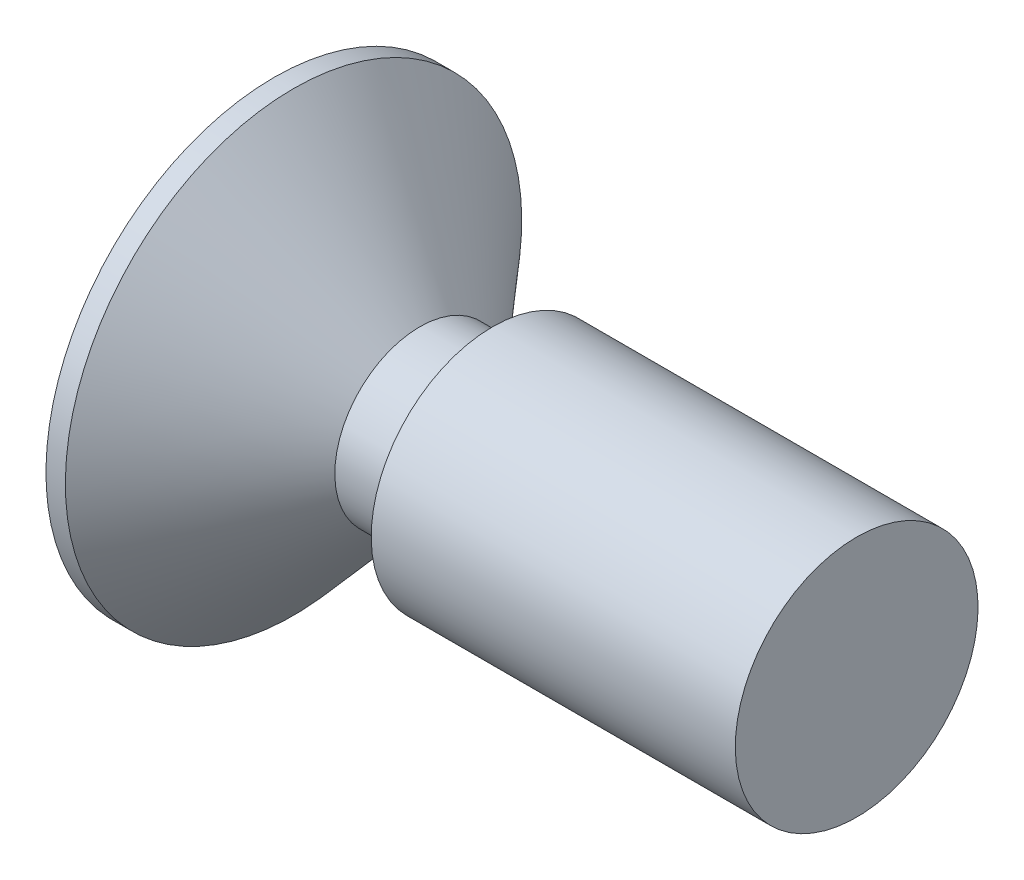
ISO-10303-21;
HEADER;
FILE_DESCRIPTION(('STEP AP214'),'2;1');
FILE_NAME('part.step','',(''),(''),'','','');
FILE_SCHEMA(('AUTOMOTIVE_DESIGN { 1 0 10303 214 1 1 1 1 }'));
ENDSEC;
DATA;
#1=APPLICATION_CONTEXT('core data for automotive mechanical design processes');
#2=APPLICATION_PROTOCOL_DEFINITION('international standard','automotive_design',2000,#1);
#3=PRODUCT_CONTEXT('',#1,'mechanical');
#4=PRODUCT('Part','Part','',(#3));
#5=PRODUCT_RELATED_PRODUCT_CATEGORY('part','',(#4));
#6=PRODUCT_DEFINITION_FORMATION('','',#4);
#7=PRODUCT_DEFINITION_CONTEXT('part definition',#1,'design');
#8=PRODUCT_DEFINITION('design','',#6,#7);
#9=PRODUCT_DEFINITION_SHAPE('','',#8);
#10=(LENGTH_UNIT() NAMED_UNIT(*) SI_UNIT(.MILLI.,.METRE.));
#11=(NAMED_UNIT(*) PLANE_ANGLE_UNIT() SI_UNIT($,.RADIAN.));
#12=(NAMED_UNIT(*) SI_UNIT($,.STERADIAN.) SOLID_ANGLE_UNIT());
#13=UNCERTAINTY_MEASURE_WITH_UNIT(LENGTH_MEASURE(1.E-05),#10,'distance_accuracy_value','');
#14=(GEOMETRIC_REPRESENTATION_CONTEXT(3) GLOBAL_UNCERTAINTY_ASSIGNED_CONTEXT((#13)) GLOBAL_UNIT_ASSIGNED_CONTEXT((#10,
#11,#12)) REPRESENTATION_CONTEXT('',''));
#15=CARTESIAN_POINT('',(0.,0.,0.));
#16=DIRECTION('',(0.,0.,1.));
#17=DIRECTION('',(1.,0.,0.));
#18=AXIS2_PLACEMENT_3D('',#15,#16,#17);
#19=CARTESIAN_POINT('',(0.,0.,0.));
#20=DIRECTION('',(1.,0.,0.));
#21=DIRECTION('',(0.,1.,0.));
#22=AXIS2_PLACEMENT_3D('',#19,#20,#21);
#23=PLANE('',#22);
#24=CARTESIAN_POINT('',(0.,0.,0.));
#25=DIRECTION('',(1.,0.,0.));
#26=DIRECTION('',(0.,1.,0.));
#27=AXIS2_PLACEMENT_3D('',#24,#25,#26);
#28=CIRCLE('',#27,1.25);
#29=CARTESIAN_POINT('',(0.,1.25,0.));
#30=VERTEX_POINT('',#29);
#31=EDGE_CURVE('E11',#30,#30,#28,.T.);
#32=ORIENTED_EDGE('',*,*,#31,.T.);
#33=EDGE_LOOP('',(#32));
#34=FACE_BOUND('',#33,.T.);
#35=ADVANCED_FACE('F42',(#34),#23,.T.);
#36=CARTESIAN_POINT('',(0.,0.,0.));
#37=DIRECTION('',(1.,0.,0.));
#38=DIRECTION('',(0.,1.,0.));
#39=AXIS2_PLACEMENT_3D('',#36,#37,#38);
#40=CYLINDRICAL_SURFACE('',#39,1.25);
#41=CARTESIAN_POINT('',(-3.75,0.,0.));
#42=DIRECTION('',(1.,0.,0.));
#43=DIRECTION('',(0.,1.,0.));
#44=AXIS2_PLACEMENT_3D('',#41,#42,#43);
#45=CIRCLE('',#44,1.25000000000001);
#46=CARTESIAN_POINT('',(-3.75,1.25000000000001,0.));
#47=VERTEX_POINT('',#46);
#48=EDGE_CURVE('E50',#47,#47,#45,.T.);
#49=ORIENTED_EDGE('',*,*,#48,.T.);
#50=EDGE_LOOP('',(#49));
#51=FACE_BOUND('',#50,.T.);
#52=ORIENTED_EDGE('',*,*,#31,.F.);
#53=EDGE_LOOP('',(#52));
#54=FACE_BOUND('',#53,.T.);
#55=ADVANCED_FACE('F316',(#51,#54),#40,.T.);
#56=CARTESIAN_POINT('',(-3.75,1.25000000000001,0.));
#57=DIRECTION('',(-1.,0.,0.));
#58=DIRECTION('',(0.,-1.,0.));
#59=AXIS2_PLACEMENT_3D('',#56,#57,#58);
#60=PLANE('',#59);
#61=CARTESIAN_POINT('',(-3.75,0.,0.));
#62=DIRECTION('',(1.,0.,0.));
#63=DIRECTION('',(0.,1.,0.));
#64=AXIS2_PLACEMENT_3D('',#61,#62,#63);
#65=CIRCLE('',#64,0.875000000000007);
#66=CARTESIAN_POINT('',(-3.75,0.875000000000006,0.));
#67=VERTEX_POINT('',#66);
#68=EDGE_CURVE('E308',#67,#67,#65,.T.);
#69=ORIENTED_EDGE('',*,*,#68,.T.);
#70=EDGE_LOOP('',(#69));
#71=FACE_BOUND('',#70,.T.);
#72=ORIENTED_EDGE('',*,*,#48,.F.);
#73=EDGE_LOOP('',(#72));
#74=FACE_BOUND('',#73,.T.);
#75=ADVANCED_FACE('F319',(#71,#74),#60,.T.);
#76=CARTESIAN_POINT('',(0.,0.,0.));
#77=DIRECTION('',(1.,0.,0.));
#78=DIRECTION('',(0.,1.,0.));
#79=AXIS2_PLACEMENT_3D('',#76,#77,#78);
#80=CYLINDRICAL_SURFACE('',#79,0.875000000000007);
#81=CARTESIAN_POINT('',(-4.5,0.,0.));
#82=DIRECTION('',(1.,0.,0.));
#83=DIRECTION('',(0.,1.,0.));
#84=AXIS2_PLACEMENT_3D('',#81,#82,#83);
#85=CIRCLE('',#84,0.875000000000007);
#86=CARTESIAN_POINT('',(-4.5,0.875000000000006,0.));
#87=VERTEX_POINT('',#86);
#88=EDGE_CURVE('E304',#87,#87,#85,.T.);
#89=ORIENTED_EDGE('',*,*,#88,.T.);
#90=EDGE_LOOP('',(#89));
#91=FACE_BOUND('',#90,.T.);
#92=ORIENTED_EDGE('',*,*,#68,.F.);
#93=EDGE_LOOP('',(#92));
#94=FACE_BOUND('',#93,.T.);
#95=ADVANCED_FACE('F321',(#91,#94),#80,.T.);
#96=CARTESIAN_POINT('',(-4.5,0.,0.));
#97=DIRECTION('',(-1.,0.,0.));
#98=DIRECTION('',(0.,-1.,0.));
#99=AXIS2_PLACEMENT_3D('',#96,#97,#98);
#100=CONICAL_SURFACE('',#99,0.875000000000007,0.84837782583039);
#101=CARTESIAN_POINT('',(-5.8,0.,0.));
#102=DIRECTION('',(1.,0.,0.));
#103=DIRECTION('',(0.,1.,0.));
#104=AXIS2_PLACEMENT_3D('',#101,#102,#103);
#105=CIRCLE('',#104,2.35);
#106=CARTESIAN_POINT('',(-5.8,2.35,0.));
#107=VERTEX_POINT('',#106);
#108=EDGE_CURVE('E300',#107,#107,#105,.T.);
#109=ORIENTED_EDGE('',*,*,#108,.T.);
#110=EDGE_LOOP('',(#109));
#111=FACE_BOUND('',#110,.T.);
#112=ORIENTED_EDGE('',*,*,#88,.F.);
#113=EDGE_LOOP('',(#112));
#114=FACE_BOUND('',#113,.T.);
#115=ADVANCED_FACE('F328',(#111,#114),#100,.T.);
#116=CARTESIAN_POINT('',(0.,0.,0.));
#117=DIRECTION('',(1.,0.,0.));
#118=DIRECTION('',(0.,1.,0.));
#119=AXIS2_PLACEMENT_3D('',#116,#117,#118);
#120=CYLINDRICAL_SURFACE('',#119,2.35);
#121=CARTESIAN_POINT('',(-6.,0.,0.));
#122=DIRECTION('',(1.,0.,0.));
#123=DIRECTION('',(0.,1.,0.));
#124=AXIS2_PLACEMENT_3D('',#121,#122,#123);
#125=CIRCLE('',#124,2.35);
#126=CARTESIAN_POINT('',(-6.,2.35,0.));
#127=VERTEX_POINT('',#126);
#128=EDGE_CURVE('E257',#127,#127,#125,.T.);
#129=ORIENTED_EDGE('',*,*,#128,.T.);
#130=EDGE_LOOP('',(#129));
#131=FACE_BOUND('',#130,.T.);
#132=ORIENTED_EDGE('',*,*,#108,.F.);
#133=EDGE_LOOP('',(#132));
#134=FACE_BOUND('',#133,.T.);
#135=ADVANCED_FACE('F354',(#131,#134),#120,.T.);
#136=CARTESIAN_POINT('',(-6.,2.35,0.));
#137=DIRECTION('',(-1.,0.,0.));
#138=DIRECTION('',(0.,-1.,0.));
#139=AXIS2_PLACEMENT_3D('',#136,#137,#138);
#140=PLANE('',#139);
#141=DIRECTION('',(0.,-1.,0.));
#142=VECTOR('',#141,1.);
#143=CARTESIAN_POINT('',(-6.,1.5,-0.3125));
#144=LINE('',#143,#142);
#145=CARTESIAN_POINT('',(-6.,1.5,-0.3125));
#146=VERTEX_POINT('',#145);
#147=CARTESIAN_POINT('',(-6.,0.5625,-0.3125));
#148=VERTEX_POINT('',#147);
#149=EDGE_CURVE('E57',#146,#148,#144,.T.);
#150=ORIENTED_EDGE('',*,*,#149,.F.);
#151=DIRECTION('',(0.,0.,-1.));
#152=VECTOR('',#151,1.);
#153=CARTESIAN_POINT('',(-6.,1.5,-0.3125));
#154=LINE('',#153,#152);
#155=CARTESIAN_POINT('',(-6.,1.5,0.3125));
#156=VERTEX_POINT('',#155);
#157=EDGE_CURVE('E251',#156,#146,#154,.T.);
#158=ORIENTED_EDGE('',*,*,#157,.F.);
#159=DIRECTION('',(0.,1.,0.));
#160=VECTOR('',#159,1.);
#161=CARTESIAN_POINT('',(-6.,1.5,0.3125));
#162=LINE('',#161,#160);
#163=CARTESIAN_POINT('',(-6.,0.5625,0.3125));
#164=VERTEX_POINT('',#163);
#165=EDGE_CURVE('E248',#164,#156,#162,.T.);
#166=ORIENTED_EDGE('',*,*,#165,.F.);
#167=CARTESIAN_POINT('',(-6.,0.562499999999999,0.5625));
#168=DIRECTION('',(1.,0.,0.));
#169=DIRECTION('',(0.,1.,0.));
#170=AXIS2_PLACEMENT_3D('',#167,#168,#169);
#171=CIRCLE('',#170,0.25);
#172=CARTESIAN_POINT('',(-6.,0.312499999999999,0.5625));
#173=VERTEX_POINT('',#172);
#174=EDGE_CURVE('E165',#173,#164,#171,.T.);
#175=ORIENTED_EDGE('',*,*,#174,.F.);
#176=DIRECTION('',(0.,0.,-1.));
#177=VECTOR('',#176,1.);
#178=CARTESIAN_POINT('',(-6.,0.312499999999999,0.5625));
#179=LINE('',#178,#177);
#180=CARTESIAN_POINT('',(-6.,0.312499999999999,1.5));
#181=VERTEX_POINT('',#180);
#182=EDGE_CURVE('E242',#181,#173,#179,.T.);
#183=ORIENTED_EDGE('',*,*,#182,.F.);
#184=DIRECTION('',(0.,1.,0.));
#185=VECTOR('',#184,1.);
#186=CARTESIAN_POINT('',(-6.,0.312499999999999,1.5));
#187=LINE('',#186,#185);
#188=CARTESIAN_POINT('',(-6.,-0.312500000000001,1.5));
#189=VERTEX_POINT('',#188);
#190=EDGE_CURVE('E239',#189,#181,#187,.T.);
#191=ORIENTED_EDGE('',*,*,#190,.F.);
#192=DIRECTION('',(0.,0.,1.));
#193=VECTOR('',#192,1.);
#194=CARTESIAN_POINT('',(-6.,-0.312500000000001,0.562500000000001));
#195=LINE('',#194,#193);
#196=CARTESIAN_POINT('',(-6.,-0.312500000000001,0.562500000000001));
#197=VERTEX_POINT('',#196);
#198=EDGE_CURVE('E235',#197,#189,#195,.T.);
#199=ORIENTED_EDGE('',*,*,#198,.F.);
#200=CARTESIAN_POINT('',(-6.,-0.562500000000001,0.5625));
#201=DIRECTION('',(1.,0.,0.));
#202=DIRECTION('',(0.,1.,0.));
#203=AXIS2_PLACEMENT_3D('',#200,#201,#202);
#204=CIRCLE('',#203,0.25);
#205=CARTESIAN_POINT('',(-6.,-0.562500000000001,0.3125));
#206=VERTEX_POINT('',#205);
#207=EDGE_CURVE('E231',#206,#197,#204,.T.);
#208=ORIENTED_EDGE('',*,*,#207,.F.);
#209=DIRECTION('',(0.,1.,0.));
#210=VECTOR('',#209,1.);
#211=CARTESIAN_POINT('',(-6.,-0.562500000000001,0.312500000000001));
#212=LINE('',#211,#210);
#213=CARTESIAN_POINT('',(-6.,-1.5,0.3125));
#214=VERTEX_POINT('',#213);
#215=EDGE_CURVE('E227',#214,#206,#212,.T.);
#216=ORIENTED_EDGE('',*,*,#215,.F.);
#217=DIRECTION('',(0.,0.,1.));
#218=VECTOR('',#217,1.);
#219=CARTESIAN_POINT('',(-6.,-1.5,-0.3125));
#220=LINE('',#219,#218);
#221=CARTESIAN_POINT('',(-6.,-1.5,-0.3125));
#222=VERTEX_POINT('',#221);
#223=EDGE_CURVE('E223',#222,#214,#220,.T.);
#224=ORIENTED_EDGE('',*,*,#223,.F.);
#225=DIRECTION('',(0.,-1.,0.));
#226=VECTOR('',#225,1.);
#227=CARTESIAN_POINT('',(-6.,-0.562500000000001,-0.3125));
#228=LINE('',#227,#226);
#229=CARTESIAN_POINT('',(-6.,-0.562500000000001,-0.3125));
#230=VERTEX_POINT('',#229);
#231=EDGE_CURVE('E219',#230,#222,#228,.T.);
#232=ORIENTED_EDGE('',*,*,#231,.F.);
#233=CARTESIAN_POINT('',(-6.,-0.562500000000001,-0.5625));
#234=DIRECTION('',(1.,0.,0.));
#235=DIRECTION('',(0.,-1.,0.));
#236=AXIS2_PLACEMENT_3D('',#233,#234,#235);
#237=CIRCLE('',#236,0.25);
#238=CARTESIAN_POINT('',(-6.,-0.312500000000001,-0.5625));
#239=VERTEX_POINT('',#238);
#240=EDGE_CURVE('E215',#239,#230,#237,.T.);
#241=ORIENTED_EDGE('',*,*,#240,.F.);
#242=DIRECTION('',(0.,0.,1.));
#243=VECTOR('',#242,1.);
#244=CARTESIAN_POINT('',(-6.,-0.312500000000001,-1.5));
#245=LINE('',#244,#243);
#246=CARTESIAN_POINT('',(-6.,-0.312500000000001,-1.5));
#247=VERTEX_POINT('',#246);
#248=EDGE_CURVE('E211',#247,#239,#245,.T.);
#249=ORIENTED_EDGE('',*,*,#248,.F.);
#250=DIRECTION('',(0.,-1.,0.));
#251=VECTOR('',#250,1.);
#252=CARTESIAN_POINT('',(-6.,0.3125,-1.5));
#253=LINE('',#252,#251);
#254=CARTESIAN_POINT('',(-6.,0.3125,-1.5));
#255=VERTEX_POINT('',#254);
#256=EDGE_CURVE('E207',#255,#247,#253,.T.);
#257=ORIENTED_EDGE('',*,*,#256,.F.);
#258=DIRECTION('',(0.,0.,-1.));
#259=VECTOR('',#258,1.);
#260=CARTESIAN_POINT('',(-6.,0.3125,-1.5));
#261=LINE('',#260,#259);
#262=CARTESIAN_POINT('',(-6.,0.312499999999999,-0.5625));
#263=VERTEX_POINT('',#262);
#264=EDGE_CURVE('E203',#263,#255,#261,.T.);
#265=ORIENTED_EDGE('',*,*,#264,.F.);
#266=CARTESIAN_POINT('',(-6.,0.562499999999999,-0.5625));
#267=DIRECTION('',(1.,0.,0.));
#268=DIRECTION('',(0.,1.,0.));
#269=AXIS2_PLACEMENT_3D('',#266,#267,#268);
#270=CIRCLE('',#269,0.25);
#271=EDGE_CURVE('E199',#148,#263,#270,.T.);
#272=ORIENTED_EDGE('',*,*,#271,.F.);
#273=EDGE_LOOP('',(#150,#158,#166,#175,#183,#191,#199,#208,#216,#224,#232,#241,#249,#257,#265,#272));
#274=FACE_BOUND('',#273,.T.);
#275=ORIENTED_EDGE('',*,*,#128,.F.);
#276=EDGE_LOOP('',(#275));
#277=FACE_BOUND('',#276,.T.);
#278=ADVANCED_FACE('F363',(#274,#277),#140,.T.);
#279=CARTESIAN_POINT('',(-5.25,1.5,-0.3125));
#280=DIRECTION('',(0.,0.,-1.));
#281=DIRECTION('',(-1.,0.,0.));
#282=AXIS2_PLACEMENT_3D('',#279,#280,#281);
#283=PLANE('',#282);
#284=ORIENTED_EDGE('',*,*,#149,.T.);
#285=DIRECTION('',(-1.,0.,0.));
#286=VECTOR('',#285,1.);
#287=CARTESIAN_POINT('',(-5.25,0.5625,-0.3125));
#288=LINE('',#287,#286);
#289=CARTESIAN_POINT('',(-5.25,0.5625,-0.3125));
#290=VERTEX_POINT('',#289);
#291=EDGE_CURVE('E117',#290,#148,#288,.T.);
#292=ORIENTED_EDGE('',*,*,#291,.F.);
#293=DIRECTION('',(0.,-1.,0.));
#294=VECTOR('',#293,1.);
#295=CARTESIAN_POINT('',(-5.25,1.5,-0.3125));
#296=LINE('',#295,#294);
#297=CARTESIAN_POINT('',(-5.25,1.5,-0.3125));
#298=VERTEX_POINT('',#297);
#299=EDGE_CURVE('E254',#298,#290,#296,.T.);
#300=ORIENTED_EDGE('',*,*,#299,.F.);
#301=DIRECTION('',(-1.,0.,0.));
#302=VECTOR('',#301,1.);
#303=CARTESIAN_POINT('',(-5.25,1.5,-0.3125));
#304=LINE('',#303,#302);
#305=EDGE_CURVE('E65',#298,#146,#304,.T.);
#306=ORIENTED_EDGE('',*,*,#305,.T.);
#307=EDGE_LOOP('',(#284,#292,#300,#306));
#308=FACE_BOUND('',#307,.T.);
#309=ADVANCED_FACE('F372',(#308),#283,.F.);
#310=CARTESIAN_POINT('',(-5.25,1.5,-0.3125));
#311=DIRECTION('',(0.,1.,0.));
#312=DIRECTION('',(-1.,0.,0.));
#313=AXIS2_PLACEMENT_3D('',#310,#311,#312);
#314=PLANE('',#313);
#315=ORIENTED_EDGE('',*,*,#157,.T.);
#316=ORIENTED_EDGE('',*,*,#305,.F.);
#317=DIRECTION('',(0.,0.,-1.));
#318=VECTOR('',#317,1.);
#319=CARTESIAN_POINT('',(-5.25,1.5,-0.3125));
#320=LINE('',#319,#318);
#321=CARTESIAN_POINT('',(-5.25,1.5,0.3125));
#322=VERTEX_POINT('',#321);
#323=EDGE_CURVE('E179',#322,#298,#320,.T.);
#324=ORIENTED_EDGE('',*,*,#323,.F.);
#325=DIRECTION('',(-1.,0.,0.));
#326=VECTOR('',#325,1.);
#327=CARTESIAN_POINT('',(-5.25,1.5,0.3125));
#328=LINE('',#327,#326);
#329=EDGE_CURVE('E170',#322,#156,#328,.T.);
#330=ORIENTED_EDGE('',*,*,#329,.T.);
#331=EDGE_LOOP('',(#315,#316,#324,#330));
#332=FACE_BOUND('',#331,.T.);
#333=ADVANCED_FACE('F381',(#332),#314,.F.);
#334=CARTESIAN_POINT('',(-5.25,1.5,0.3125));
#335=DIRECTION('',(0.,0.,1.));
#336=DIRECTION('',(0.,-1.,0.));
#337=AXIS2_PLACEMENT_3D('',#334,#335,#336);
#338=PLANE('',#337);
#339=ORIENTED_EDGE('',*,*,#165,.T.);
#340=ORIENTED_EDGE('',*,*,#329,.F.);
#341=DIRECTION('',(0.,1.,0.));
#342=VECTOR('',#341,1.);
#343=CARTESIAN_POINT('',(-5.25,1.5,0.3125));
#344=LINE('',#343,#342);
#345=CARTESIAN_POINT('',(-5.25,0.5625,0.3125));
#346=VERTEX_POINT('',#345);
#347=EDGE_CURVE('E174',#346,#322,#344,.T.);
#348=ORIENTED_EDGE('',*,*,#347,.F.);
#349=DIRECTION('',(-1.,0.,0.));
#350=VECTOR('',#349,1.);
#351=CARTESIAN_POINT('',(-5.25,0.5625,0.3125));
#352=LINE('',#351,#350);
#353=EDGE_CURVE('E158',#346,#164,#352,.T.);
#354=ORIENTED_EDGE('',*,*,#353,.T.);
#355=EDGE_LOOP('',(#339,#340,#348,#354));
#356=FACE_BOUND('',#355,.T.);
#357=ADVANCED_FACE('F175',(#356),#338,.F.);
#358=CARTESIAN_POINT('',(-5.25,0.562499999999999,0.5625));
#359=DIRECTION('',(-1.,0.,0.));
#360=DIRECTION('',(0.,-1.,0.));
#361=AXIS2_PLACEMENT_3D('',#358,#359,#360);
#362=CYLINDRICAL_SURFACE('',#361,0.25);
#363=ORIENTED_EDGE('',*,*,#174,.T.);
#364=ORIENTED_EDGE('',*,*,#353,.F.);
#365=CARTESIAN_POINT('',(-5.25,0.562499999999999,0.5625));
#366=DIRECTION('',(1.,0.,0.));
#367=DIRECTION('',(0.,1.,0.));
#368=AXIS2_PLACEMENT_3D('',#365,#366,#367);
#369=CIRCLE('',#368,0.25);
#370=CARTESIAN_POINT('',(-5.25,0.312499999999999,0.5625));
#371=VERTEX_POINT('',#370);
#372=EDGE_CURVE('E162',#371,#346,#369,.T.);
#373=ORIENTED_EDGE('',*,*,#372,.F.);
#374=DIRECTION('',(-1.,0.,0.));
#375=VECTOR('',#374,1.);
#376=CARTESIAN_POINT('',(-5.25,0.312499999999999,0.5625));
#377=LINE('',#376,#375);
#378=EDGE_CURVE('E171',#371,#173,#377,.T.);
#379=ORIENTED_EDGE('',*,*,#378,.T.);
#380=EDGE_LOOP('',(#363,#364,#373,#379));
#381=FACE_BOUND('',#380,.T.);
#382=ADVANCED_FACE('F160',(#381),#362,.T.);
#383=CARTESIAN_POINT('',(-5.25,0.3125,0.5625));
#384=DIRECTION('',(0.,1.,0.));
#385=DIRECTION('',(-1.,0.,0.));
#386=AXIS2_PLACEMENT_3D('',#383,#384,#385);
#387=PLANE('',#386);
#388=ORIENTED_EDGE('',*,*,#182,.T.);
#389=ORIENTED_EDGE('',*,*,#378,.F.);
#390=DIRECTION('',(0.,0.,-1.));
#391=VECTOR('',#390,1.);
#392=CARTESIAN_POINT('',(-5.25,0.3125,0.5625));
#393=LINE('',#392,#391);
#394=CARTESIAN_POINT('',(-5.25,0.3125,1.5));
#395=VERTEX_POINT('',#394);
#396=EDGE_CURVE('E185',#395,#371,#393,.T.);
#397=ORIENTED_EDGE('',*,*,#396,.F.);
#398=DIRECTION('',(-1.,0.,0.));
#399=VECTOR('',#398,1.);
#400=CARTESIAN_POINT('',(-5.25,0.3125,1.5));
#401=LINE('',#400,#399);
#402=EDGE_CURVE('E262',#395,#181,#401,.T.);
#403=ORIENTED_EDGE('',*,*,#402,.T.);
#404=EDGE_LOOP('',(#388,#389,#397,#403));
#405=FACE_BOUND('',#404,.T.);
#406=ADVANCED_FACE('F403',(#405),#387,.F.);
#407=CARTESIAN_POINT('',(-5.25,0.3125,1.5));
#408=DIRECTION('',(0.,0.,1.));
#409=DIRECTION('',(0.,-1.,0.));
#410=AXIS2_PLACEMENT_3D('',#407,#408,#409);
#411=PLANE('',#410);
#412=ORIENTED_EDGE('',*,*,#190,.T.);
#413=ORIENTED_EDGE('',*,*,#402,.F.);
#414=DIRECTION('',(0.,1.,0.));
#415=VECTOR('',#414,1.);
#416=CARTESIAN_POINT('',(-5.25,0.3125,1.5));
#417=LINE('',#416,#415);
#418=CARTESIAN_POINT('',(-5.25,-0.3125,1.5));
#419=VERTEX_POINT('',#418);
#420=EDGE_CURVE('E191',#419,#395,#417,.T.);
#421=ORIENTED_EDGE('',*,*,#420,.F.);
#422=DIRECTION('',(-1.,0.,0.));
#423=VECTOR('',#422,1.);
#424=CARTESIAN_POINT('',(-5.25,-0.3125,1.5));
#425=LINE('',#424,#423);
#426=EDGE_CURVE('E265',#419,#189,#425,.T.);
#427=ORIENTED_EDGE('',*,*,#426,.T.);
#428=EDGE_LOOP('',(#412,#413,#421,#427));
#429=FACE_BOUND('',#428,.T.);
#430=ADVANCED_FACE('F411',(#429),#411,.F.);
#431=CARTESIAN_POINT('',(-5.25,-0.3125,0.562500000000001));
#432=DIRECTION('',(0.,-1.,0.));
#433=DIRECTION('',(1.,0.,0.));
#434=AXIS2_PLACEMENT_3D('',#431,#432,#433);
#435=PLANE('',#434);
#436=ORIENTED_EDGE('',*,*,#198,.T.);
#437=ORIENTED_EDGE('',*,*,#426,.F.);
#438=DIRECTION('',(0.,0.,1.));
#439=VECTOR('',#438,1.);
#440=CARTESIAN_POINT('',(-5.25,-0.3125,0.562500000000001));
#441=LINE('',#440,#439);
#442=CARTESIAN_POINT('',(-5.25,-0.3125,0.562500000000001));
#443=VERTEX_POINT('',#442);
#444=EDGE_CURVE('E617',#443,#419,#441,.T.);
#445=ORIENTED_EDGE('',*,*,#444,.F.);
#446=DIRECTION('',(-1.,0.,0.));
#447=VECTOR('',#446,1.);
#448=CARTESIAN_POINT('',(-5.25,-0.3125,0.562500000000001));
#449=LINE('',#448,#447);
#450=EDGE_CURVE('E268',#443,#197,#449,.T.);
#451=ORIENTED_EDGE('',*,*,#450,.T.);
#452=EDGE_LOOP('',(#436,#437,#445,#451));
#453=FACE_BOUND('',#452,.T.);
#454=ADVANCED_FACE('F420',(#453),#435,.F.);
#455=CARTESIAN_POINT('',(-5.25,-0.5625,0.5625));
#456=DIRECTION('',(-1.,0.,0.));
#457=DIRECTION('',(0.,-1.,0.));
#458=AXIS2_PLACEMENT_3D('',#455,#456,#457);
#459=CYLINDRICAL_SURFACE('',#458,0.25);
#460=ORIENTED_EDGE('',*,*,#207,.T.);
#461=ORIENTED_EDGE('',*,*,#450,.F.);
#462=CARTESIAN_POINT('',(-5.25,-0.5625,0.5625));
#463=DIRECTION('',(1.,0.,0.));
#464=DIRECTION('',(0.,1.,0.));
#465=AXIS2_PLACEMENT_3D('',#462,#463,#464);
#466=CIRCLE('',#465,0.25);
#467=CARTESIAN_POINT('',(-5.25,-0.562500000000001,0.3125));
#468=VERTEX_POINT('',#467);
#469=EDGE_CURVE('E613',#468,#443,#466,.T.);
#470=ORIENTED_EDGE('',*,*,#469,.F.);
#471=DIRECTION('',(-1.,0.,0.));
#472=VECTOR('',#471,1.);
#473=CARTESIAN_POINT('',(-5.25,-0.562500000000001,0.3125));
#474=LINE('',#473,#472);
#475=EDGE_CURVE('E271',#468,#206,#474,.T.);
#476=ORIENTED_EDGE('',*,*,#475,.T.);
#477=EDGE_LOOP('',(#460,#461,#470,#476));
#478=FACE_BOUND('',#477,.T.);
#479=ADVANCED_FACE('F429',(#478),#459,.T.);
#480=CARTESIAN_POINT('',(-5.25,-0.562500000000001,0.312500000000001));
#481=DIRECTION('',(0.,0.,1.));
#482=DIRECTION('',(0.,-1.,0.));
#483=AXIS2_PLACEMENT_3D('',#480,#481,#482);
#484=PLANE('',#483);
#485=ORIENTED_EDGE('',*,*,#215,.T.);
#486=ORIENTED_EDGE('',*,*,#475,.F.);
#487=DIRECTION('',(0.,1.,0.));
#488=VECTOR('',#487,1.);
#489=CARTESIAN_POINT('',(-5.25,-0.562500000000001,0.312500000000001));
#490=LINE('',#489,#488);
#491=CARTESIAN_POINT('',(-5.25,-1.5,0.3125));
#492=VERTEX_POINT('',#491);
#493=EDGE_CURVE('E609',#492,#468,#490,.T.);
#494=ORIENTED_EDGE('',*,*,#493,.F.);
#495=DIRECTION('',(-1.,0.,0.));
#496=VECTOR('',#495,1.);
#497=CARTESIAN_POINT('',(-5.25,-1.5,0.3125));
#498=LINE('',#497,#496);
#499=EDGE_CURVE('E274',#492,#214,#498,.T.);
#500=ORIENTED_EDGE('',*,*,#499,.T.);
#501=EDGE_LOOP('',(#485,#486,#494,#500));
#502=FACE_BOUND('',#501,.T.);
#503=ADVANCED_FACE('F438',(#502),#484,.F.);
#504=CARTESIAN_POINT('',(-5.25,-1.5,-0.3125));
#505=DIRECTION('',(0.,-1.,0.));
#506=DIRECTION('',(1.,0.,0.));
#507=AXIS2_PLACEMENT_3D('',#504,#505,#506);
#508=PLANE('',#507);
#509=ORIENTED_EDGE('',*,*,#223,.T.);
#510=ORIENTED_EDGE('',*,*,#499,.F.);
#511=DIRECTION('',(0.,0.,1.));
#512=VECTOR('',#511,1.);
#513=CARTESIAN_POINT('',(-5.25,-1.5,-0.3125));
#514=LINE('',#513,#512);
#515=CARTESIAN_POINT('',(-5.25,-1.5,-0.3125));
#516=VERTEX_POINT('',#515);
#517=EDGE_CURVE('E605',#516,#492,#514,.T.);
#518=ORIENTED_EDGE('',*,*,#517,.F.);
#519=DIRECTION('',(-1.,0.,0.));
#520=VECTOR('',#519,1.);
#521=CARTESIAN_POINT('',(-5.25,-1.5,-0.3125));
#522=LINE('',#521,#520);
#523=EDGE_CURVE('E277',#516,#222,#522,.T.);
#524=ORIENTED_EDGE('',*,*,#523,.T.);
#525=EDGE_LOOP('',(#509,#510,#518,#524));
#526=FACE_BOUND('',#525,.T.);
#527=ADVANCED_FACE('F447',(#526),#508,.F.);
#528=CARTESIAN_POINT('',(-5.25,-0.562500000000001,-0.3125));
#529=DIRECTION('',(0.,0.,-1.));
#530=DIRECTION('',(-1.,0.,0.));
#531=AXIS2_PLACEMENT_3D('',#528,#529,#530);
#532=PLANE('',#531);
#533=ORIENTED_EDGE('',*,*,#231,.T.);
#534=ORIENTED_EDGE('',*,*,#523,.F.);
#535=DIRECTION('',(0.,-1.,0.));
#536=VECTOR('',#535,1.);
#537=CARTESIAN_POINT('',(-5.25,-0.562500000000001,-0.3125));
#538=LINE('',#537,#536);
#539=CARTESIAN_POINT('',(-5.25,-0.562500000000001,-0.3125));
#540=VERTEX_POINT('',#539);
#541=EDGE_CURVE('E601',#540,#516,#538,.T.);
#542=ORIENTED_EDGE('',*,*,#541,.F.);
#543=DIRECTION('',(-1.,0.,0.));
#544=VECTOR('',#543,1.);
#545=CARTESIAN_POINT('',(-5.25,-0.562500000000001,-0.3125));
#546=LINE('',#545,#544);
#547=EDGE_CURVE('E280',#540,#230,#546,.T.);
#548=ORIENTED_EDGE('',*,*,#547,.T.);
#549=EDGE_LOOP('',(#533,#534,#542,#548));
#550=FACE_BOUND('',#549,.T.);
#551=ADVANCED_FACE('F456',(#550),#532,.F.);
#552=CARTESIAN_POINT('',(-5.25,-0.562500000000001,-0.5625));
#553=DIRECTION('',(-1.,0.,0.));
#554=DIRECTION('',(0.,-1.,0.));
#555=AXIS2_PLACEMENT_3D('',#552,#553,#554);
#556=CYLINDRICAL_SURFACE('',#555,0.25);
#557=ORIENTED_EDGE('',*,*,#240,.T.);
#558=ORIENTED_EDGE('',*,*,#547,.F.);
#559=CARTESIAN_POINT('',(-5.25,-0.562500000000001,-0.5625));
#560=DIRECTION('',(1.,0.,0.));
#561=DIRECTION('',(0.,-1.,0.));
#562=AXIS2_PLACEMENT_3D('',#559,#560,#561);
#563=CIRCLE('',#562,0.25);
#564=CARTESIAN_POINT('',(-5.25,-0.312500000000001,-0.5625));
#565=VERTEX_POINT('',#564);
#566=EDGE_CURVE('E597',#565,#540,#563,.T.);
#567=ORIENTED_EDGE('',*,*,#566,.F.);
#568=DIRECTION('',(-1.,0.,0.));
#569=VECTOR('',#568,1.);
#570=CARTESIAN_POINT('',(-5.25,-0.312500000000001,-0.5625));
#571=LINE('',#570,#569);
#572=EDGE_CURVE('E283',#565,#239,#571,.T.);
#573=ORIENTED_EDGE('',*,*,#572,.T.);
#574=EDGE_LOOP('',(#557,#558,#567,#573));
#575=FACE_BOUND('',#574,.T.);
#576=ADVANCED_FACE('F465',(#575),#556,.T.);
#577=CARTESIAN_POINT('',(-5.25,-0.3125,-1.5));
#578=DIRECTION('',(0.,-1.,0.));
#579=DIRECTION('',(0.,0.,-1.));
#580=AXIS2_PLACEMENT_3D('',#577,#578,#579);
#581=PLANE('',#580);
#582=ORIENTED_EDGE('',*,*,#248,.T.);
#583=ORIENTED_EDGE('',*,*,#572,.F.);
#584=DIRECTION('',(0.,0.,1.));
#585=VECTOR('',#584,1.);
#586=CARTESIAN_POINT('',(-5.25,-0.3125,-1.5));
#587=LINE('',#586,#585);
#588=CARTESIAN_POINT('',(-5.25,-0.3125,-1.5));
#589=VERTEX_POINT('',#588);
#590=EDGE_CURVE('E593',#589,#565,#587,.T.);
#591=ORIENTED_EDGE('',*,*,#590,.F.);
#592=DIRECTION('',(-1.,0.,0.));
#593=VECTOR('',#592,1.);
#594=CARTESIAN_POINT('',(-5.25,-0.3125,-1.5));
#595=LINE('',#594,#593);
#596=EDGE_CURVE('E286',#589,#247,#595,.T.);
#597=ORIENTED_EDGE('',*,*,#596,.T.);
#598=EDGE_LOOP('',(#582,#583,#591,#597));
#599=FACE_BOUND('',#598,.T.);
#600=ADVANCED_FACE('F474',(#599),#581,.F.);
#601=CARTESIAN_POINT('',(-5.25,0.3125,-1.5));
#602=DIRECTION('',(0.,0.,-1.));
#603=DIRECTION('',(0.,1.,0.));
#604=AXIS2_PLACEMENT_3D('',#601,#602,#603);
#605=PLANE('',#604);
#606=ORIENTED_EDGE('',*,*,#256,.T.);
#607=ORIENTED_EDGE('',*,*,#596,.F.);
#608=DIRECTION('',(0.,-1.,0.));
#609=VECTOR('',#608,1.);
#610=CARTESIAN_POINT('',(-5.25,0.3125,-1.5));
#611=LINE('',#610,#609);
#612=CARTESIAN_POINT('',(-5.25,0.3125,-1.5));
#613=VERTEX_POINT('',#612);
#614=EDGE_CURVE('E584',#613,#589,#611,.T.);
#615=ORIENTED_EDGE('',*,*,#614,.F.);
#616=DIRECTION('',(-1.,0.,0.));
#617=VECTOR('',#616,1.);
#618=CARTESIAN_POINT('',(-5.25,0.3125,-1.5));
#619=LINE('',#618,#617);
#620=EDGE_CURVE('E289',#613,#255,#619,.T.);
#621=ORIENTED_EDGE('',*,*,#620,.T.);
#622=EDGE_LOOP('',(#606,#607,#615,#621));
#623=FACE_BOUND('',#622,.T.);
#624=ADVANCED_FACE('F483',(#623),#605,.F.);
#625=CARTESIAN_POINT('',(-5.25,0.3125,-1.5));
#626=DIRECTION('',(0.,1.,0.));
#627=DIRECTION('',(0.,0.,1.));
#628=AXIS2_PLACEMENT_3D('',#625,#626,#627);
#629=PLANE('',#628);
#630=ORIENTED_EDGE('',*,*,#264,.T.);
#631=ORIENTED_EDGE('',*,*,#620,.F.);
#632=DIRECTION('',(0.,0.,-1.));
#633=VECTOR('',#632,1.);
#634=CARTESIAN_POINT('',(-5.25,0.3125,-1.5));
#635=LINE('',#634,#633);
#636=CARTESIAN_POINT('',(-5.25,0.312499999999999,-0.5625));
#637=VERTEX_POINT('',#636);
#638=EDGE_CURVE('E581',#637,#613,#635,.T.);
#639=ORIENTED_EDGE('',*,*,#638,.F.);
#640=DIRECTION('',(-1.,0.,0.));
#641=VECTOR('',#640,1.);
#642=CARTESIAN_POINT('',(-5.25,0.312499999999999,-0.5625));
#643=LINE('',#642,#641);
#644=EDGE_CURVE('E292',#637,#263,#643,.T.);
#645=ORIENTED_EDGE('',*,*,#644,.T.);
#646=EDGE_LOOP('',(#630,#631,#639,#645));
#647=FACE_BOUND('',#646,.T.);
#648=ADVANCED_FACE('F492',(#647),#629,.F.);
#649=CARTESIAN_POINT('',(-5.25,0.562499999999999,-0.5625));
#650=DIRECTION('',(-1.,0.,0.));
#651=DIRECTION('',(0.,-1.,0.));
#652=AXIS2_PLACEMENT_3D('',#649,#650,#651);
#653=CYLINDRICAL_SURFACE('',#652,0.25);
#654=ORIENTED_EDGE('',*,*,#271,.T.);
#655=ORIENTED_EDGE('',*,*,#644,.F.);
#656=CARTESIAN_POINT('',(-5.25,0.562499999999999,-0.5625));
#657=DIRECTION('',(1.,0.,0.));
#658=DIRECTION('',(0.,1.,0.));
#659=AXIS2_PLACEMENT_3D('',#656,#657,#658);
#660=CIRCLE('',#659,0.25);
#661=EDGE_CURVE('E585',#290,#637,#660,.T.);
#662=ORIENTED_EDGE('',*,*,#661,.F.);
#663=ORIENTED_EDGE('',*,*,#291,.T.);
#664=EDGE_LOOP('',(#654,#655,#662,#663));
#665=FACE_BOUND('',#664,.T.);
#666=ADVANCED_FACE('F501',(#665),#653,.T.);
#667=CARTESIAN_POINT('',(-5.25,0.562499999999999,-0.5625));
#668=DIRECTION('',(1.,0.,0.));
#669=DIRECTION('',(0.,1.,0.));
#670=AXIS2_PLACEMENT_3D('',#667,#668,#669);
#671=PLANE('',#670);
#672=ORIENTED_EDGE('',*,*,#299,.T.);
#673=ORIENTED_EDGE('',*,*,#661,.T.);
#674=ORIENTED_EDGE('',*,*,#638,.T.);
#675=ORIENTED_EDGE('',*,*,#614,.T.);
#676=ORIENTED_EDGE('',*,*,#590,.T.);
#677=ORIENTED_EDGE('',*,*,#566,.T.);
#678=ORIENTED_EDGE('',*,*,#541,.T.);
#679=ORIENTED_EDGE('',*,*,#517,.T.);
#680=ORIENTED_EDGE('',*,*,#493,.T.);
#681=ORIENTED_EDGE('',*,*,#469,.T.);
#682=ORIENTED_EDGE('',*,*,#444,.T.);
#683=ORIENTED_EDGE('',*,*,#420,.T.);
#684=ORIENTED_EDGE('',*,*,#396,.T.);
#685=ORIENTED_EDGE('',*,*,#372,.T.);
#686=ORIENTED_EDGE('',*,*,#347,.T.);
#687=ORIENTED_EDGE('',*,*,#323,.T.);
#688=EDGE_LOOP('',(#672,#673,#674,#675,#676,#677,#678,#679,#680,#681,#682,#683,#684,#685,#686,#687));
#689=FACE_BOUND('',#688,.T.);
#690=ADVANCED_FACE('F182',(#689),#671,.F.);
#691=CLOSED_SHELL('',(#35,#55,#75,#95,#115,#135,#278,#309,#333,#357,#382,#406,#430,#454,#479,
#503,#527,#551,#576,#600,#624,#648,#666,#690));
#692=MANIFOLD_SOLID_BREP('B2',#691);
#693=ADVANCED_BREP_SHAPE_REPRESENTATION('',(#18,#692),#14);
#694=SHAPE_DEFINITION_REPRESENTATION(#9,#693);
ENDSEC;
END-ISO-10303-21;
